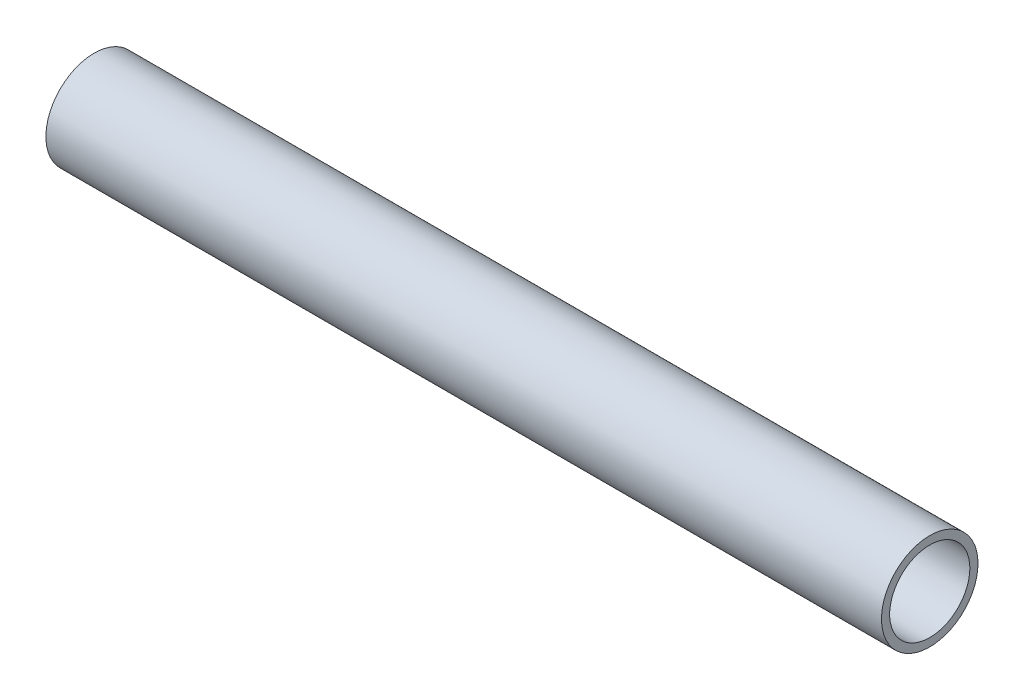
ISO-10303-21;
HEADER;
FILE_DESCRIPTION(('STEP AP214'),'2;1');
FILE_NAME('part.step','',(''),(''),'','','');
FILE_SCHEMA(('AUTOMOTIVE_DESIGN { 1 0 10303 214 1 1 1 1 }'));
ENDSEC;
DATA;
#1=APPLICATION_CONTEXT('core data for automotive mechanical design processes');
#2=APPLICATION_PROTOCOL_DEFINITION('international standard','automotive_design',2000,#1);
#3=PRODUCT_CONTEXT('',#1,'mechanical');
#4=PRODUCT('Part','Part','',(#3));
#5=PRODUCT_RELATED_PRODUCT_CATEGORY('part','',(#4));
#6=PRODUCT_DEFINITION_FORMATION('','',#4);
#7=PRODUCT_DEFINITION_CONTEXT('part definition',#1,'design');
#8=PRODUCT_DEFINITION('design','',#6,#7);
#9=PRODUCT_DEFINITION_SHAPE('','',#8);
#10=(LENGTH_UNIT() NAMED_UNIT(*) SI_UNIT(.MILLI.,.METRE.));
#11=(NAMED_UNIT(*) PLANE_ANGLE_UNIT() SI_UNIT($,.RADIAN.));
#12=(NAMED_UNIT(*) SI_UNIT($,.STERADIAN.) SOLID_ANGLE_UNIT());
#13=UNCERTAINTY_MEASURE_WITH_UNIT(LENGTH_MEASURE(1.E-05),#10,'distance_accuracy_value','');
#14=(GEOMETRIC_REPRESENTATION_CONTEXT(3) GLOBAL_UNCERTAINTY_ASSIGNED_CONTEXT((#13)) GLOBAL_UNIT_ASSIGNED_CONTEXT((#10,
#11,#12)) REPRESENTATION_CONTEXT('',''));
#15=CARTESIAN_POINT('',(0.,0.,0.));
#16=DIRECTION('',(0.,0.,1.));
#17=DIRECTION('',(1.,0.,0.));
#18=AXIS2_PLACEMENT_3D('',#15,#16,#17);
#19=CARTESIAN_POINT('',(-182.5625,0.,0.));
#20=DIRECTION('',(1.,0.,0.));
#21=DIRECTION('',(0.,0.,-1.));
#22=AXIS2_PLACEMENT_3D('',#19,#20,#21);
#23=CYLINDRICAL_SURFACE('',#22,17.526);
#24=CARTESIAN_POINT('',(182.5625,0.,0.));
#25=DIRECTION('',(1.,0.,0.));
#26=DIRECTION('',(0.,0.,-1.));
#27=AXIS2_PLACEMENT_3D('',#24,#25,#26);
#28=CIRCLE('',#27,17.526);
#29=CARTESIAN_POINT('',(182.5625,0.,-17.526));
#30=VERTEX_POINT('',#29);
#31=EDGE_CURVE('E17',#30,#30,#28,.F.);
#32=ORIENTED_EDGE('',*,*,#31,.F.);
#33=EDGE_LOOP('',(#32));
#34=FACE_BOUND('',#33,.T.);
#35=CARTESIAN_POINT('',(-182.5625,0.,0.));
#36=DIRECTION('',(1.,0.,0.));
#37=DIRECTION('',(0.,0.,-1.));
#38=AXIS2_PLACEMENT_3D('',#35,#36,#37);
#39=CIRCLE('',#38,17.526);
#40=CARTESIAN_POINT('',(-182.5625,0.,-17.526));
#41=VERTEX_POINT('',#40);
#42=EDGE_CURVE('E26',#41,#41,#39,.F.);
#43=ORIENTED_EDGE('',*,*,#42,.T.);
#44=EDGE_LOOP('',(#43));
#45=FACE_BOUND('',#44,.T.);
#46=ADVANCED_FACE('F14',(#34,#45),#23,.F.);
#47=CARTESIAN_POINT('',(182.5625,0.,0.));
#48=DIRECTION('',(1.,0.,0.));
#49=DIRECTION('',(0.,0.,-1.));
#50=AXIS2_PLACEMENT_3D('',#47,#48,#49);
#51=PLANE('',#50);
#52=ORIENTED_EDGE('',*,*,#31,.T.);
#53=EDGE_LOOP('',(#52));
#54=FACE_BOUND('',#53,.T.);
#55=CARTESIAN_POINT('',(182.5625,0.,0.));
#56=DIRECTION('',(1.,0.,0.));
#57=DIRECTION('',(0.,0.,-1.));
#58=AXIS2_PLACEMENT_3D('',#55,#56,#57);
#59=CIRCLE('',#58,21.082);
#60=CARTESIAN_POINT('',(182.5625,0.,-21.082));
#61=VERTEX_POINT('',#60);
#62=EDGE_CURVE('E21',#61,#61,#59,.F.);
#63=ORIENTED_EDGE('',*,*,#62,.F.);
#64=EDGE_LOOP('',(#63));
#65=FACE_BOUND('',#64,.T.);
#66=ADVANCED_FACE('F34',(#54,#65),#51,.T.);
#67=CARTESIAN_POINT('',(-182.5625,0.,0.));
#68=DIRECTION('',(1.,0.,0.));
#69=DIRECTION('',(0.,0.,-1.));
#70=AXIS2_PLACEMENT_3D('',#67,#68,#69);
#71=PLANE('',#70);
#72=ORIENTED_EDGE('',*,*,#42,.F.);
#73=EDGE_LOOP('',(#72));
#74=FACE_BOUND('',#73,.T.);
#75=CARTESIAN_POINT('',(-182.5625,0.,0.));
#76=DIRECTION('',(1.,0.,0.));
#77=DIRECTION('',(0.,0.,-1.));
#78=AXIS2_PLACEMENT_3D('',#75,#76,#77);
#79=CIRCLE('',#78,21.082);
#80=CARTESIAN_POINT('',(-182.5625,0.,-21.082));
#81=VERTEX_POINT('',#80);
#82=EDGE_CURVE('E10',#81,#81,#79,.T.);
#83=ORIENTED_EDGE('',*,*,#82,.F.);
#84=EDGE_LOOP('',(#83));
#85=FACE_BOUND('',#84,.T.);
#86=ADVANCED_FACE('F42',(#74,#85),#71,.F.);
#87=CARTESIAN_POINT('',(-182.5625,0.,0.));
#88=DIRECTION('',(1.,0.,0.));
#89=DIRECTION('',(0.,0.,-1.));
#90=AXIS2_PLACEMENT_3D('',#87,#88,#89);
#91=CYLINDRICAL_SURFACE('',#90,21.082);
#92=ORIENTED_EDGE('',*,*,#62,.T.);
#93=EDGE_LOOP('',(#92));
#94=FACE_BOUND('',#93,.T.);
#95=ORIENTED_EDGE('',*,*,#82,.T.);
#96=EDGE_LOOP('',(#95));
#97=FACE_BOUND('',#96,.T.);
#98=ADVANCED_FACE('F43',(#94,#97),#91,.T.);
#99=CLOSED_SHELL('',(#46,#66,#86,#98));
#100=MANIFOLD_SOLID_BREP('B1',#99);
#101=ADVANCED_BREP_SHAPE_REPRESENTATION('',(#18,#100),#14);
#102=SHAPE_DEFINITION_REPRESENTATION(#9,#101);
ENDSEC;
END-ISO-10303-21;
